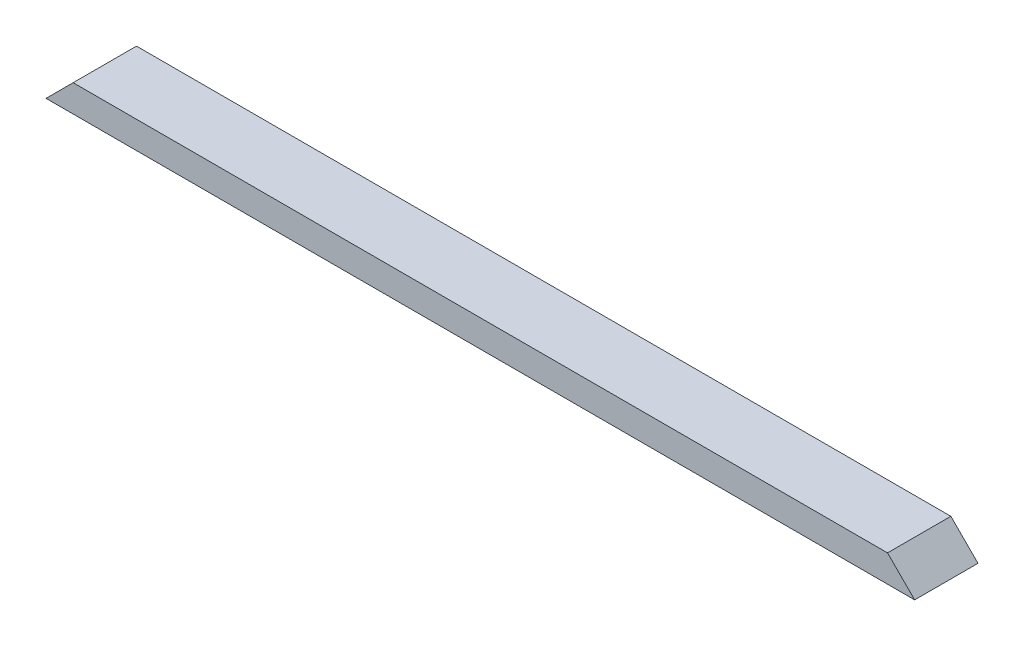
ISO-10303-21;
HEADER;
FILE_DESCRIPTION(('STEP AP214'),'2;1');
FILE_NAME('part.step','',(''),(''),'','','');
FILE_SCHEMA(('AUTOMOTIVE_DESIGN { 1 0 10303 214 1 1 1 1 }'));
ENDSEC;
DATA;
#1=APPLICATION_CONTEXT('core data for automotive mechanical design processes');
#2=APPLICATION_PROTOCOL_DEFINITION('international standard','automotive_design',2000,#1);
#3=PRODUCT_CONTEXT('',#1,'mechanical');
#4=PRODUCT('Part','Part','',(#3));
#5=PRODUCT_RELATED_PRODUCT_CATEGORY('part','',(#4));
#6=PRODUCT_DEFINITION_FORMATION('','',#4);
#7=PRODUCT_DEFINITION_CONTEXT('part definition',#1,'design');
#8=PRODUCT_DEFINITION('design','',#6,#7);
#9=PRODUCT_DEFINITION_SHAPE('','',#8);
#10=(LENGTH_UNIT() NAMED_UNIT(*) SI_UNIT(.MILLI.,.METRE.));
#11=(NAMED_UNIT(*) PLANE_ANGLE_UNIT() SI_UNIT($,.RADIAN.));
#12=(NAMED_UNIT(*) SI_UNIT($,.STERADIAN.) SOLID_ANGLE_UNIT());
#13=UNCERTAINTY_MEASURE_WITH_UNIT(LENGTH_MEASURE(1.E-05),#10,'distance_accuracy_value','');
#14=(GEOMETRIC_REPRESENTATION_CONTEXT(3) GLOBAL_UNCERTAINTY_ASSIGNED_CONTEXT((#13)) GLOBAL_UNIT_ASSIGNED_CONTEXT((#10,
#11,#12)) REPRESENTATION_CONTEXT('',''));
#15=CARTESIAN_POINT('',(0.,0.,0.));
#16=DIRECTION('',(0.,0.,1.));
#17=DIRECTION('',(1.,0.,0.));
#18=AXIS2_PLACEMENT_3D('',#15,#16,#17);
#19=CARTESIAN_POINT('',(0.,38.1,0.));
#20=DIRECTION('',(0.,0.,-1.));
#21=DIRECTION('',(-1.,0.,0.));
#22=AXIS2_PLACEMENT_3D('',#19,#20,#21);
#23=PLANE('',#22);
#24=DIRECTION('',(1.,0.,0.));
#25=VECTOR('',#24,1.);
#26=CARTESIAN_POINT('',(0.,38.1,0.));
#27=LINE('',#26,#25);
#28=CARTESIAN_POINT('',(38.1,38.1,0.));
#29=VERTEX_POINT('',#28);
#30=CARTESIAN_POINT('',(1181.1,38.0999999999999,0.));
#31=VERTEX_POINT('',#30);
#32=EDGE_CURVE('E47',#29,#31,#27,.T.);
#33=ORIENTED_EDGE('',*,*,#32,.F.);
#34=DIRECTION('',(0.707106781186547,0.707106781186547,0.));
#35=VECTOR('',#34,1.);
#36=CARTESIAN_POINT('',(0.,0.,0.));
#37=LINE('',#36,#35);
#38=CARTESIAN_POINT('',(0.,0.,0.));
#39=VERTEX_POINT('',#38);
#40=EDGE_CURVE('E82',#39,#29,#37,.T.);
#41=ORIENTED_EDGE('',*,*,#40,.F.);
#42=DIRECTION('',(1.,0.,0.));
#43=VECTOR('',#42,1.);
#44=CARTESIAN_POINT('',(0.,0.,0.));
#45=LINE('',#44,#43);
#46=CARTESIAN_POINT('',(1219.2,0.,0.));
#47=VERTEX_POINT('',#46);
#48=EDGE_CURVE('E87',#39,#47,#45,.T.);
#49=ORIENTED_EDGE('',*,*,#48,.T.);
#50=DIRECTION('',(0.707106781186549,-0.707106781186546,0.));
#51=VECTOR('',#50,1.);
#52=CARTESIAN_POINT('',(1181.1,38.0999999999999,0.));
#53=LINE('',#52,#51);
#54=EDGE_CURVE('E63',#31,#47,#53,.T.);
#55=ORIENTED_EDGE('',*,*,#54,.F.);
#56=EDGE_LOOP('',(#33,#41,#49,#55));
#57=FACE_BOUND('',#56,.T.);
#58=ADVANCED_FACE('F39',(#57),#23,.F.);
#59=CARTESIAN_POINT('',(0.,38.1,-88.9));
#60=DIRECTION('',(0.,0.,1.));
#61=DIRECTION('',(1.,0.,0.));
#62=AXIS2_PLACEMENT_3D('',#59,#60,#61);
#63=PLANE('',#62);
#64=DIRECTION('',(-1.,0.,0.));
#65=VECTOR('',#64,1.);
#66=CARTESIAN_POINT('',(0.,0.,-88.9));
#67=LINE('',#66,#65);
#68=CARTESIAN_POINT('',(1219.2,0.,-88.9));
#69=VERTEX_POINT('',#68);
#70=CARTESIAN_POINT('',(0.,0.,-88.9));
#71=VERTEX_POINT('',#70);
#72=EDGE_CURVE('E42',#69,#71,#67,.T.);
#73=ORIENTED_EDGE('',*,*,#72,.T.);
#74=DIRECTION('',(0.707106781186547,0.707106781186547,0.));
#75=VECTOR('',#74,1.);
#76=CARTESIAN_POINT('',(0.,0.,-88.9));
#77=LINE('',#76,#75);
#78=CARTESIAN_POINT('',(38.1,38.1,-88.9));
#79=VERTEX_POINT('',#78);
#80=EDGE_CURVE('E55',#71,#79,#77,.T.);
#81=ORIENTED_EDGE('',*,*,#80,.T.);
#82=DIRECTION('',(-1.,0.,0.));
#83=VECTOR('',#82,1.);
#84=CARTESIAN_POINT('',(0.,38.1,-88.9));
#85=LINE('',#84,#83);
#86=CARTESIAN_POINT('',(1181.1,38.0999999999999,-88.9));
#87=VERTEX_POINT('',#86);
#88=EDGE_CURVE('E11',#87,#79,#85,.T.);
#89=ORIENTED_EDGE('',*,*,#88,.F.);
#90=DIRECTION('',(0.707106781186549,-0.707106781186546,0.));
#91=VECTOR('',#90,1.);
#92=CARTESIAN_POINT('',(1181.1,38.0999999999999,-88.9));
#93=LINE('',#92,#91);
#94=EDGE_CURVE('E100',#87,#69,#93,.T.);
#95=ORIENTED_EDGE('',*,*,#94,.T.);
#96=EDGE_LOOP('',(#73,#81,#89,#95));
#97=FACE_BOUND('',#96,.T.);
#98=ADVANCED_FACE('F109',(#97),#63,.F.);
#99=CARTESIAN_POINT('',(0.,38.1,0.));
#100=DIRECTION('',(0.,-1.,0.));
#101=DIRECTION('',(0.,0.,-1.));
#102=AXIS2_PLACEMENT_3D('',#99,#100,#101);
#103=PLANE('',#102);
#104=ORIENTED_EDGE('',*,*,#88,.T.);
#105=DIRECTION('',(0.,0.,1.));
#106=VECTOR('',#105,1.);
#107=CARTESIAN_POINT('',(38.1,38.1,-88.9));
#108=LINE('',#107,#106);
#109=EDGE_CURVE('E88',#79,#29,#108,.T.);
#110=ORIENTED_EDGE('',*,*,#109,.T.);
#111=ORIENTED_EDGE('',*,*,#32,.T.);
#112=DIRECTION('',(0.,0.,1.));
#113=VECTOR('',#112,1.);
#114=CARTESIAN_POINT('',(1181.1,38.0999999999999,-88.9));
#115=LINE('',#114,#113);
#116=EDGE_CURVE('E103',#87,#31,#115,.T.);
#117=ORIENTED_EDGE('',*,*,#116,.F.);
#118=EDGE_LOOP('',(#104,#110,#111,#117));
#119=FACE_BOUND('',#118,.T.);
#120=ADVANCED_FACE('F112',(#119),#103,.F.);
#121=CARTESIAN_POINT('',(0.,0.,0.));
#122=DIRECTION('',(0.,-1.,0.));
#123=DIRECTION('',(0.,0.,-1.));
#124=AXIS2_PLACEMENT_3D('',#121,#122,#123);
#125=PLANE('',#124);
#126=DIRECTION('',(0.,0.,1.));
#127=VECTOR('',#126,1.);
#128=CARTESIAN_POINT('',(0.,0.,0.));
#129=LINE('',#128,#127);
#130=EDGE_CURVE('E79',#71,#39,#129,.T.);
#131=ORIENTED_EDGE('',*,*,#130,.F.);
#132=ORIENTED_EDGE('',*,*,#72,.F.);
#133=DIRECTION('',(0.,0.,-1.));
#134=VECTOR('',#133,1.);
#135=CARTESIAN_POINT('',(1219.2,0.,0.));
#136=LINE('',#135,#134);
#137=EDGE_CURVE('E96',#47,#69,#136,.T.);
#138=ORIENTED_EDGE('',*,*,#137,.F.);
#139=ORIENTED_EDGE('',*,*,#48,.F.);
#140=EDGE_LOOP('',(#131,#132,#138,#139));
#141=FACE_BOUND('',#140,.T.);
#142=ADVANCED_FACE('F95',(#141),#125,.T.);
#143=CARTESIAN_POINT('',(1181.1,38.0999999999999,-88.9));
#144=DIRECTION('',(-0.707106781186546,-0.707106781186549,0.));
#145=DIRECTION('',(0.707106781186549,-0.707106781186546,0.));
#146=AXIS2_PLACEMENT_3D('',#143,#144,#145);
#147=PLANE('',#146);
#148=ORIENTED_EDGE('',*,*,#54,.T.);
#149=ORIENTED_EDGE('',*,*,#137,.T.);
#150=ORIENTED_EDGE('',*,*,#94,.F.);
#151=ORIENTED_EDGE('',*,*,#116,.T.);
#152=EDGE_LOOP('',(#148,#149,#150,#151));
#153=FACE_BOUND('',#152,.T.);
#154=ADVANCED_FACE('F113',(#153),#147,.F.);
#155=CARTESIAN_POINT('',(0.,0.,-88.9));
#156=DIRECTION('',(0.707106781186547,-0.707106781186547,0.));
#157=DIRECTION('',(0.707106781186548,0.707106781186548,0.));
#158=AXIS2_PLACEMENT_3D('',#155,#156,#157);
#159=PLANE('',#158);
#160=ORIENTED_EDGE('',*,*,#40,.T.);
#161=ORIENTED_EDGE('',*,*,#109,.F.);
#162=ORIENTED_EDGE('',*,*,#80,.F.);
#163=ORIENTED_EDGE('',*,*,#130,.T.);
#164=EDGE_LOOP('',(#160,#161,#162,#163));
#165=FACE_BOUND('',#164,.T.);
#166=ADVANCED_FACE('F81',(#165),#159,.F.);
#167=CLOSED_SHELL('',(#58,#98,#120,#142,#154,#166));
#168=MANIFOLD_SOLID_BREP('B2',#167);
#169=ADVANCED_BREP_SHAPE_REPRESENTATION('',(#18,#168),#14);
#170=SHAPE_DEFINITION_REPRESENTATION(#9,#169);
ENDSEC;
END-ISO-10303-21;
